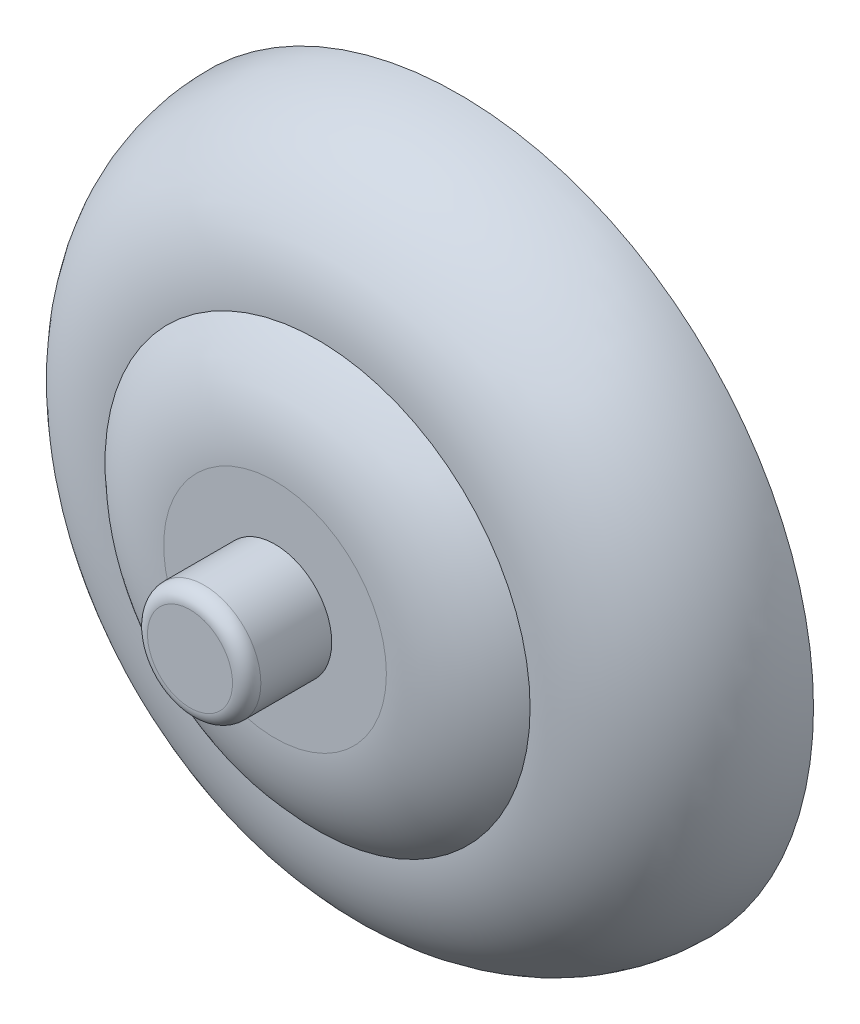
ISO-10303-21;
HEADER;
FILE_DESCRIPTION(('STEP AP214'),'2;1');
FILE_NAME('part.step','',(''),(''),'','','');
FILE_SCHEMA(('AUTOMOTIVE_DESIGN { 1 0 10303 214 1 1 1 1 }'));
ENDSEC;
DATA;
#1=APPLICATION_CONTEXT('core data for automotive mechanical design processes');
#2=APPLICATION_PROTOCOL_DEFINITION('international standard','automotive_design',2000,#1);
#3=PRODUCT_CONTEXT('',#1,'mechanical');
#4=PRODUCT('Part','Part','',(#3));
#5=PRODUCT_RELATED_PRODUCT_CATEGORY('part','',(#4));
#6=PRODUCT_DEFINITION_FORMATION('','',#4);
#7=PRODUCT_DEFINITION_CONTEXT('part definition',#1,'design');
#8=PRODUCT_DEFINITION('design','',#6,#7);
#9=PRODUCT_DEFINITION_SHAPE('','',#8);
#10=(LENGTH_UNIT() NAMED_UNIT(*) SI_UNIT(.MILLI.,.METRE.));
#11=(NAMED_UNIT(*) PLANE_ANGLE_UNIT() SI_UNIT($,.RADIAN.));
#12=(NAMED_UNIT(*) SI_UNIT($,.STERADIAN.) SOLID_ANGLE_UNIT());
#13=UNCERTAINTY_MEASURE_WITH_UNIT(LENGTH_MEASURE(1.E-05),#10,'distance_accuracy_value','');
#14=(GEOMETRIC_REPRESENTATION_CONTEXT(3) GLOBAL_UNCERTAINTY_ASSIGNED_CONTEXT((#13)) GLOBAL_UNIT_ASSIGNED_CONTEXT((#10,
#11,#12)) REPRESENTATION_CONTEXT('',''));
#15=CARTESIAN_POINT('',(0.,0.,0.));
#16=DIRECTION('',(0.,0.,1.));
#17=DIRECTION('',(1.,0.,0.));
#18=AXIS2_PLACEMENT_3D('',#15,#16,#17);
#19=CARTESIAN_POINT('',(0.,0.,0.));
#20=DIRECTION('',(0.,0.,1.));
#21=DIRECTION('',(1.,0.,0.));
#22=AXIS2_PLACEMENT_3D('',#19,#20,#21);
#23=PLANE('',#22);
#24=CARTESIAN_POINT('',(0.,0.,0.));
#25=DIRECTION('',(0.,0.,1.));
#26=DIRECTION('',(1.,0.,0.));
#27=AXIS2_PLACEMENT_3D('',#24,#25,#26);
#28=CIRCLE('',#27,25.);
#29=CARTESIAN_POINT('',(25.,0.,0.));
#30=VERTEX_POINT('',#29);
#31=EDGE_CURVE('E58',#30,#30,#28,.T.);
#32=ORIENTED_EDGE('',*,*,#31,.F.);
#33=EDGE_LOOP('',(#32));
#34=FACE_BOUND('',#33,.T.);
#35=ADVANCED_FACE('F37',(#34),#23,.F.);
#36=CARTESIAN_POINT('',(0.,0.,13.));
#37=DIRECTION('',(0.,0.,1.));
#38=DIRECTION('',(1.,0.,0.));
#39=AXIS2_PLACEMENT_3D('',#36,#37,#38);
#40=PLANE('',#39);
#41=CARTESIAN_POINT('',(0.,0.,13.));
#42=DIRECTION('',(0.,0.,1.));
#43=DIRECTION('',(1.,0.,0.));
#44=AXIS2_PLACEMENT_3D('',#41,#42,#43);
#45=CIRCLE('',#44,7.85857157145715);
#46=CARTESIAN_POINT('',(7.85857157145715,0.,13.));
#47=VERTEX_POINT('',#46);
#48=EDGE_CURVE('E50',#47,#47,#45,.T.);
#49=ORIENTED_EDGE('',*,*,#48,.T.);
#50=EDGE_LOOP('',(#49));
#51=FACE_BOUND('',#50,.T.);
#52=CARTESIAN_POINT('',(0.,0.,13.));
#53=DIRECTION('',(0.,0.,1.));
#54=DIRECTION('',(1.,0.,0.));
#55=AXIS2_PLACEMENT_3D('',#52,#53,#54);
#56=CIRCLE('',#55,4.);
#57=CARTESIAN_POINT('',(4.,0.,13.));
#58=VERTEX_POINT('',#57);
#59=EDGE_CURVE('E55',#58,#58,#56,.T.);
#60=ORIENTED_EDGE('',*,*,#59,.F.);
#61=EDGE_LOOP('',(#60));
#62=FACE_BOUND('',#61,.T.);
#63=ADVANCED_FACE('F72',(#51,#62),#40,.T.);
#64=CARTESIAN_POINT('',(0.,0.,19.));
#65=DIRECTION('',(0.,0.,-1.));
#66=DIRECTION('',(-1.,0.,0.));
#67=AXIS2_PLACEMENT_3D('',#64,#65,#66);
#68=CYLINDRICAL_SURFACE('',#67,4.);
#69=CARTESIAN_POINT('',(0.,0.,18.));
#70=DIRECTION('',(0.,0.,1.));
#71=DIRECTION('',(1.,0.,0.));
#72=AXIS2_PLACEMENT_3D('',#69,#70,#71);
#73=CIRCLE('',#72,4.);
#74=CARTESIAN_POINT('',(4.,0.,18.));
#75=VERTEX_POINT('',#74);
#76=EDGE_CURVE('E10',#75,#75,#73,.F.);
#77=ORIENTED_EDGE('',*,*,#76,.T.);
#78=EDGE_LOOP('',(#77));
#79=FACE_BOUND('',#78,.T.);
#80=ORIENTED_EDGE('',*,*,#59,.T.);
#81=EDGE_LOOP('',(#80));
#82=FACE_BOUND('',#81,.T.);
#83=ADVANCED_FACE('F70',(#79,#82),#68,.T.);
#84=CARTESIAN_POINT('',(0.,0.,19.));
#85=DIRECTION('',(0.,0.,1.));
#86=DIRECTION('',(1.,0.,0.));
#87=AXIS2_PLACEMENT_3D('',#84,#85,#86);
#88=PLANE('',#87);
#89=CARTESIAN_POINT('',(0.,0.,19.));
#90=DIRECTION('',(0.,0.,1.));
#91=DIRECTION('',(1.,0.,0.));
#92=AXIS2_PLACEMENT_3D('',#89,#90,#91);
#93=CIRCLE('',#92,3.);
#94=CARTESIAN_POINT('',(3.,0.,19.));
#95=VERTEX_POINT('',#94);
#96=EDGE_CURVE('E45',#95,#95,#93,.T.);
#97=ORIENTED_EDGE('',*,*,#96,.T.);
#98=EDGE_LOOP('',(#97));
#99=FACE_BOUND('',#98,.T.);
#100=ADVANCED_FACE('F80',(#99),#88,.T.);
#101=CARTESIAN_POINT('',(0.,0.,3.));
#102=DIRECTION('',(0.,0.,-1.));
#103=DIRECTION('',(-1.,0.,0.));
#104=AXIS2_PLACEMENT_3D('',#101,#102,#103);
#105=DEGENERATE_TOROIDAL_SURFACE('',#104,7.85857157145715,10.,.T.);
#106=CARTESIAN_POINT('',(0.,0.,10.));
#107=DIRECTION('',(0.,0.,1.));
#108=DIRECTION('',(1.,0.,0.));
#109=AXIS2_PLACEMENT_3D('',#106,#107,#108);
#110=CIRCLE('',#109,15.);
#111=CARTESIAN_POINT('',(15.,0.,10.));
#112=VERTEX_POINT('',#111);
#113=EDGE_CURVE('E62',#112,#112,#110,.T.);
#114=ORIENTED_EDGE('',*,*,#113,.T.);
#115=EDGE_LOOP('',(#114));
#116=FACE_BOUND('',#115,.T.);
#117=ORIENTED_EDGE('',*,*,#48,.F.);
#118=EDGE_LOOP('',(#117));
#119=FACE_BOUND('',#118,.T.);
#120=ADVANCED_FACE('F86',(#116,#119),#105,.T.);
#121=CARTESIAN_POINT('',(0.,0.,18.));
#122=DIRECTION('',(0.,0.,1.));
#123=DIRECTION('',(1.,0.,0.));
#124=AXIS2_PLACEMENT_3D('',#121,#122,#123);
#125=TOROIDAL_SURFACE('',#124,3.,1.);
#126=ORIENTED_EDGE('',*,*,#76,.F.);
#127=EDGE_LOOP('',(#126));
#128=FACE_BOUND('',#127,.T.);
#129=ORIENTED_EDGE('',*,*,#96,.F.);
#130=EDGE_LOOP('',(#129));
#131=FACE_BOUND('',#130,.T.);
#132=ADVANCED_FACE('F88',(#128,#131),#125,.T.);
#133=CARTESIAN_POINT('',(0.,0.,0.));
#134=DIRECTION('',(0.,0.,1.));
#135=DIRECTION('',(1.,0.,0.));
#136=AXIS2_PLACEMENT_3D('',#133,#134,#135);
#137=TOROIDAL_SURFACE('',#136,15.,10.);
#138=ORIENTED_EDGE('',*,*,#31,.T.);
#139=EDGE_LOOP('',(#138));
#140=FACE_BOUND('',#139,.T.);
#141=ORIENTED_EDGE('',*,*,#113,.F.);
#142=EDGE_LOOP('',(#141));
#143=FACE_BOUND('',#142,.T.);
#144=ADVANCED_FACE('F39',(#140,#143),#137,.T.);
#145=CLOSED_SHELL('',(#35,#63,#83,#100,#120,#132,#144));
#146=MANIFOLD_SOLID_BREP('B2',#145);
#147=ADVANCED_BREP_SHAPE_REPRESENTATION('',(#18,#146),#14);
#148=SHAPE_DEFINITION_REPRESENTATION(#9,#147);
ENDSEC;
END-ISO-10303-21;
